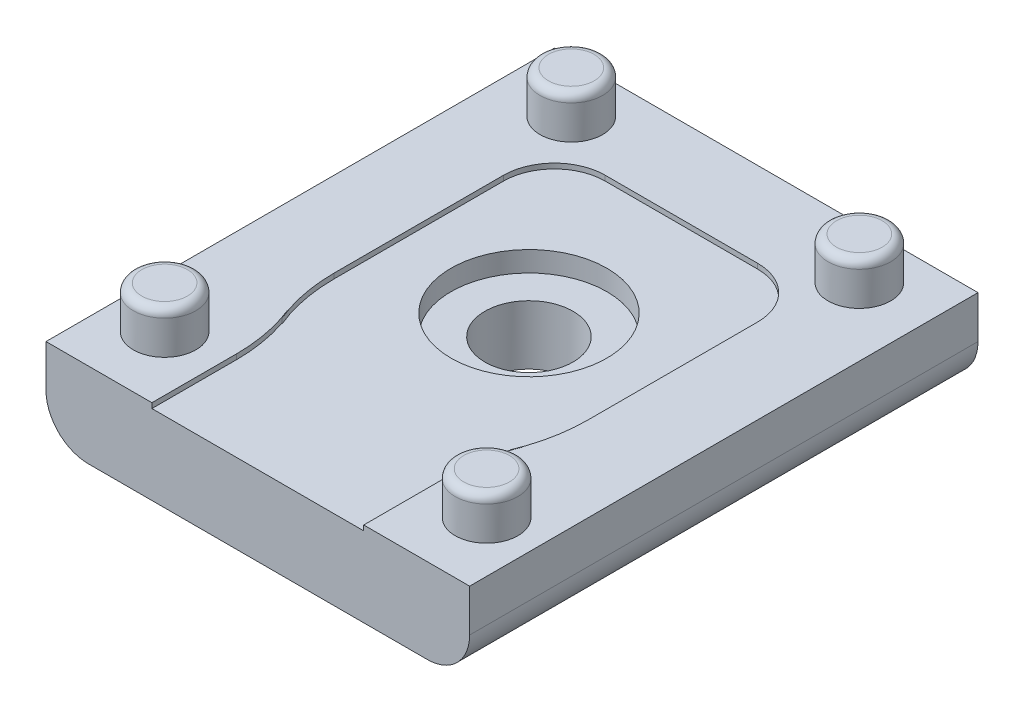
ISO-10303-21;
HEADER;
FILE_DESCRIPTION(('STEP AP214'),'2;1');
FILE_NAME('part.step','',(''),(''),'','','');
FILE_SCHEMA(('AUTOMOTIVE_DESIGN { 1 0 10303 214 1 1 1 1 }'));
ENDSEC;
DATA;
#1=APPLICATION_CONTEXT('core data for automotive mechanical design processes');
#2=APPLICATION_PROTOCOL_DEFINITION('international standard','automotive_design',2000,#1);
#3=PRODUCT_CONTEXT('',#1,'mechanical');
#4=PRODUCT('Part','Part','',(#3));
#5=PRODUCT_RELATED_PRODUCT_CATEGORY('part','',(#4));
#6=PRODUCT_DEFINITION_FORMATION('','',#4);
#7=PRODUCT_DEFINITION_CONTEXT('part definition',#1,'design');
#8=PRODUCT_DEFINITION('design','',#6,#7);
#9=PRODUCT_DEFINITION_SHAPE('','',#8);
#10=(LENGTH_UNIT() NAMED_UNIT(*) SI_UNIT(.MILLI.,.METRE.));
#11=(NAMED_UNIT(*) PLANE_ANGLE_UNIT() SI_UNIT($,.RADIAN.));
#12=(NAMED_UNIT(*) SI_UNIT($,.STERADIAN.) SOLID_ANGLE_UNIT());
#13=UNCERTAINTY_MEASURE_WITH_UNIT(LENGTH_MEASURE(1.E-05),#10,'distance_accuracy_value','');
#14=(GEOMETRIC_REPRESENTATION_CONTEXT(3) GLOBAL_UNCERTAINTY_ASSIGNED_CONTEXT((#13)) GLOBAL_UNIT_ASSIGNED_CONTEXT((#10,
#11,#12)) REPRESENTATION_CONTEXT('',''));
#15=CARTESIAN_POINT('',(0.,0.,0.));
#16=DIRECTION('',(0.,0.,1.));
#17=DIRECTION('',(1.,0.,0.));
#18=AXIS2_PLACEMENT_3D('',#15,#16,#17);
#19=CARTESIAN_POINT('',(12.5,-5.,-16.));
#20=DIRECTION('',(0.,1.,0.));
#21=DIRECTION('',(0.,0.,1.));
#22=AXIS2_PLACEMENT_3D('',#19,#20,#21);
#23=CYLINDRICAL_SURFACE('',#22,2.6);
#24=CARTESIAN_POINT('',(12.5,0.,-16.));
#25=DIRECTION('',(0.,-1.,0.));
#26=DIRECTION('',(0.,0.,-1.));
#27=AXIS2_PLACEMENT_3D('',#24,#25,#26);
#28=CIRCLE('',#27,2.6);
#29=CARTESIAN_POINT('',(12.5,0.,-18.6));
#30=VERTEX_POINT('',#29);
#31=EDGE_CURVE('E216',#30,#30,#28,.T.);
#32=ORIENTED_EDGE('',*,*,#31,.T.);
#33=EDGE_LOOP('',(#32));
#34=FACE_BOUND('',#33,.T.);
#35=CARTESIAN_POINT('',(12.5,3.5,-16.));
#36=DIRECTION('',(0.,1.,0.));
#37=DIRECTION('',(0.,0.,1.));
#38=AXIS2_PLACEMENT_3D('',#35,#36,#37);
#39=CIRCLE('',#38,2.6);
#40=CARTESIAN_POINT('',(12.5,3.5,-13.4));
#41=VERTEX_POINT('',#40);
#42=EDGE_CURVE('E418',#41,#41,#39,.F.);
#43=ORIENTED_EDGE('',*,*,#42,.F.);
#44=EDGE_LOOP('',(#43));
#45=FACE_BOUND('',#44,.T.);
#46=ADVANCED_FACE('F41',(#34,#45),#23,.F.);
#47=CARTESIAN_POINT('',(0.,5.,0.));
#48=DIRECTION('',(0.,0.,-1.));
#49=DIRECTION('',(-1.,0.,0.));
#50=AXIS2_PLACEMENT_3D('',#47,#48,#49);
#51=PLANE('',#50);
#52=DIRECTION('',(1.,0.,0.));
#53=VECTOR('',#52,1.);
#54=CARTESIAN_POINT('',(0.,0.,0.));
#55=LINE('',#54,#53);
#56=CARTESIAN_POINT('',(2.5,0.,0.));
#57=VERTEX_POINT('',#56);
#58=CARTESIAN_POINT('',(22.5,0.,0.));
#59=VERTEX_POINT('',#58);
#60=EDGE_CURVE('E304',#57,#59,#55,.T.);
#61=ORIENTED_EDGE('',*,*,#60,.T.);
#62=CARTESIAN_POINT('',(22.5,2.5,0.));
#63=DIRECTION('',(0.,0.,-1.));
#64=DIRECTION('',(-1.,0.,0.));
#65=AXIS2_PLACEMENT_3D('',#62,#63,#64);
#66=CIRCLE('',#65,2.5);
#67=CARTESIAN_POINT('',(25.,2.5,0.));
#68=VERTEX_POINT('',#67);
#69=EDGE_CURVE('E411',#59,#68,#66,.F.);
#70=ORIENTED_EDGE('',*,*,#69,.T.);
#71=DIRECTION('',(0.,-1.,0.));
#72=VECTOR('',#71,1.);
#73=CARTESIAN_POINT('',(25.,5.,0.));
#74=LINE('',#73,#72);
#75=CARTESIAN_POINT('',(25.,5.,0.));
#76=VERTEX_POINT('',#75);
#77=EDGE_CURVE('E370',#76,#68,#74,.T.);
#78=ORIENTED_EDGE('',*,*,#77,.F.);
#79=DIRECTION('',(1.,0.,0.));
#80=VECTOR('',#79,1.);
#81=CARTESIAN_POINT('',(0.,5.,0.));
#82=LINE('',#81,#80);
#83=CARTESIAN_POINT('',(18.75,5.,0.));
#84=VERTEX_POINT('',#83);
#85=EDGE_CURVE('E345',#84,#76,#82,.T.);
#86=ORIENTED_EDGE('',*,*,#85,.F.);
#87=DIRECTION('',(0.,1.,0.));
#88=VECTOR('',#87,1.);
#89=CARTESIAN_POINT('',(18.75,4.7,0.));
#90=LINE('',#89,#88);
#91=CARTESIAN_POINT('',(18.75,4.7,0.));
#92=VERTEX_POINT('',#91);
#93=EDGE_CURVE('E317',#92,#84,#90,.T.);
#94=ORIENTED_EDGE('',*,*,#93,.F.);
#95=DIRECTION('',(1.,0.,0.));
#96=VECTOR('',#95,1.);
#97=CARTESIAN_POINT('',(6.25,4.7,0.));
#98=LINE('',#97,#96);
#99=CARTESIAN_POINT('',(6.25,4.7,0.));
#100=VERTEX_POINT('',#99);
#101=EDGE_CURVE('E240',#100,#92,#98,.T.);
#102=ORIENTED_EDGE('',*,*,#101,.F.);
#103=DIRECTION('',(0.,1.,0.));
#104=VECTOR('',#103,1.);
#105=CARTESIAN_POINT('',(6.25,4.7,0.));
#106=LINE('',#105,#104);
#107=CARTESIAN_POINT('',(6.25,5.,0.));
#108=VERTEX_POINT('',#107);
#109=EDGE_CURVE('E320',#100,#108,#106,.T.);
#110=ORIENTED_EDGE('',*,*,#109,.T.);
#111=CARTESIAN_POINT('',(0.,5.,0.));
#112=VERTEX_POINT('',#111);
#113=EDGE_CURVE('E347',#112,#108,#82,.T.);
#114=ORIENTED_EDGE('',*,*,#113,.F.);
#115=DIRECTION('',(0.,-1.,0.));
#116=VECTOR('',#115,1.);
#117=CARTESIAN_POINT('',(0.,5.,0.));
#118=LINE('',#117,#116);
#119=CARTESIAN_POINT('',(0.,2.5,0.));
#120=VERTEX_POINT('',#119);
#121=EDGE_CURVE('E374',#112,#120,#118,.T.);
#122=ORIENTED_EDGE('',*,*,#121,.T.);
#123=CARTESIAN_POINT('',(2.5,2.5,0.));
#124=DIRECTION('',(0.,0.,-1.));
#125=DIRECTION('',(-1.,0.,0.));
#126=AXIS2_PLACEMENT_3D('',#123,#124,#125);
#127=CIRCLE('',#126,2.5);
#128=EDGE_CURVE('E57',#120,#57,#127,.F.);
#129=ORIENTED_EDGE('',*,*,#128,.T.);
#130=EDGE_LOOP('',(#61,#70,#78,#86,#94,#102,#110,#114,#122,#129));
#131=FACE_BOUND('',#130,.T.);
#132=ADVANCED_FACE('F465',(#131),#51,.F.);
#133=CARTESIAN_POINT('',(0.,5.,0.));
#134=DIRECTION('',(0.,-1.,0.));
#135=DIRECTION('',(0.,0.,-1.));
#136=AXIS2_PLACEMENT_3D('',#133,#134,#135);
#137=PLANE('',#136);
#138=CARTESIAN_POINT('',(3.,5.,-4.));
#139=DIRECTION('',(0.,-1.,0.));
#140=DIRECTION('',(0.,0.,-1.));
#141=AXIS2_PLACEMENT_3D('',#138,#139,#140);
#142=CIRCLE('',#141,1.85);
#143=CARTESIAN_POINT('',(3.,5.,-5.85));
#144=VERTEX_POINT('',#143);
#145=EDGE_CURVE('E390',#144,#144,#142,.F.);
#146=ORIENTED_EDGE('',*,*,#145,.F.);
#147=EDGE_LOOP('',(#146));
#148=FACE_BOUND('',#147,.T.);
#149=CARTESIAN_POINT('',(22.,5.,-4.));
#150=DIRECTION('',(0.,-1.,0.));
#151=DIRECTION('',(0.,0.,-1.));
#152=AXIS2_PLACEMENT_3D('',#149,#150,#151);
#153=CIRCLE('',#152,1.85);
#154=CARTESIAN_POINT('',(22.,5.,-5.85));
#155=VERTEX_POINT('',#154);
#156=EDGE_CURVE('E386',#155,#155,#153,.F.);
#157=ORIENTED_EDGE('',*,*,#156,.F.);
#158=EDGE_LOOP('',(#157));
#159=FACE_BOUND('',#158,.T.);
#160=CARTESIAN_POINT('',(21.,5.,-27.));
#161=DIRECTION('',(0.,-1.,0.));
#162=DIRECTION('',(0.,0.,-1.));
#163=AXIS2_PLACEMENT_3D('',#160,#161,#162);
#164=CIRCLE('',#163,1.85);
#165=CARTESIAN_POINT('',(21.,5.,-28.85));
#166=VERTEX_POINT('',#165);
#167=EDGE_CURVE('E382',#166,#166,#164,.F.);
#168=ORIENTED_EDGE('',*,*,#167,.F.);
#169=EDGE_LOOP('',(#168));
#170=FACE_BOUND('',#169,.T.);
#171=CARTESIAN_POINT('',(3.99999999999999,5.,-27.));
#172=DIRECTION('',(0.,-1.,0.));
#173=DIRECTION('',(0.,0.,-1.));
#174=AXIS2_PLACEMENT_3D('',#171,#172,#173);
#175=CIRCLE('',#174,1.85);
#176=CARTESIAN_POINT('',(3.99999999999999,5.,-28.85));
#177=VERTEX_POINT('',#176);
#178=EDGE_CURVE('E378',#177,#177,#175,.F.);
#179=ORIENTED_EDGE('',*,*,#178,.F.);
#180=EDGE_LOOP('',(#179));
#181=FACE_BOUND('',#180,.T.);
#182=DIRECTION('',(0.,0.,1.));
#183=VECTOR('',#182,1.);
#184=CARTESIAN_POINT('',(18.75,5.,-4.99999999999996));
#185=LINE('',#184,#183);
#186=CARTESIAN_POINT('',(18.75,5.,-4.99999999999997));
#187=VERTEX_POINT('',#186);
#188=EDGE_CURVE('E286',#187,#84,#185,.T.);
#189=ORIENTED_EDGE('',*,*,#188,.T.);
#190=ORIENTED_EDGE('',*,*,#85,.T.);
#191=DIRECTION('',(0.,0.,-1.));
#192=VECTOR('',#191,1.);
#193=CARTESIAN_POINT('',(25.,5.,0.));
#194=LINE('',#193,#192);
#195=CARTESIAN_POINT('',(25.,5.,-30.));
#196=VERTEX_POINT('',#195);
#197=EDGE_CURVE('E351',#76,#196,#194,.T.);
#198=ORIENTED_EDGE('',*,*,#197,.T.);
#199=DIRECTION('',(-1.,0.,0.));
#200=VECTOR('',#199,1.);
#201=CARTESIAN_POINT('',(0.,5.,-30.));
#202=LINE('',#201,#200);
#203=CARTESIAN_POINT('',(0.,5.,-30.));
#204=VERTEX_POINT('',#203);
#205=EDGE_CURVE('E354',#196,#204,#202,.T.);
#206=ORIENTED_EDGE('',*,*,#205,.T.);
#207=DIRECTION('',(0.,0.,1.));
#208=VECTOR('',#207,1.);
#209=CARTESIAN_POINT('',(0.,5.,0.));
#210=LINE('',#209,#208);
#211=EDGE_CURVE('E341',#204,#112,#210,.T.);
#212=ORIENTED_EDGE('',*,*,#211,.T.);
#213=ORIENTED_EDGE('',*,*,#113,.T.);
#214=DIRECTION('',(0.,0.,1.));
#215=VECTOR('',#214,1.);
#216=CARTESIAN_POINT('',(6.24999999999999,5.,-5.00000000000001));
#217=LINE('',#216,#215);
#218=CARTESIAN_POINT('',(6.24999999999999,5.,-5.00000000000001));
#219=VERTEX_POINT('',#218);
#220=EDGE_CURVE('E283',#219,#108,#217,.T.);
#221=ORIENTED_EDGE('',*,*,#220,.F.);
#222=CARTESIAN_POINT('',(-3.75000000000001,5.,-5.00000000000002));
#223=DIRECTION('',(0.,-1.,0.));
#224=DIRECTION('',(0.,0.,-1.));
#225=AXIS2_PLACEMENT_3D('',#222,#223,#224);
#226=CIRCLE('',#225,10.);
#227=CARTESIAN_POINT('',(5.48076923076923,5.,-8.84615384615384));
#228=VERTEX_POINT('',#227);
#229=EDGE_CURVE('E279',#228,#219,#226,.T.);
#230=ORIENTED_EDGE('',*,*,#229,.F.);
#231=DIRECTION('',(-0.384615384615383,0.,-0.923076923076924));
#232=VECTOR('',#231,1.);
#233=CARTESIAN_POINT('',(5.76923076923076,5.,-8.15384615384617));
#234=LINE('',#233,#232);
#235=CARTESIAN_POINT('',(5.76923076923076,5.,-8.15384615384617));
#236=VERTEX_POINT('',#235);
#237=EDGE_CURVE('E275',#236,#228,#234,.T.);
#238=ORIENTED_EDGE('',*,*,#237,.F.);
#239=CARTESIAN_POINT('',(15.,5.,-12.));
#240=DIRECTION('',(0.,-1.,0.));
#241=DIRECTION('',(0.,0.,-1.));
#242=AXIS2_PLACEMENT_3D('',#239,#240,#241);
#243=CIRCLE('',#242,10.);
#244=CARTESIAN_POINT('',(4.99999999999999,5.,-12.));
#245=VERTEX_POINT('',#244);
#246=EDGE_CURVE('E271',#236,#245,#243,.T.);
#247=ORIENTED_EDGE('',*,*,#246,.T.);
#248=DIRECTION('',(0.,0.,1.));
#249=VECTOR('',#248,1.);
#250=CARTESIAN_POINT('',(4.99999999999999,5.,-22.));
#251=LINE('',#250,#249);
#252=CARTESIAN_POINT('',(4.99999999999999,5.,-22.));
#253=VERTEX_POINT('',#252);
#254=EDGE_CURVE('E267',#253,#245,#251,.T.);
#255=ORIENTED_EDGE('',*,*,#254,.F.);
#256=CARTESIAN_POINT('',(7.99999999999999,5.,-22.));
#257=DIRECTION('',(0.,1.,0.));
#258=DIRECTION('',(0.,0.,1.));
#259=AXIS2_PLACEMENT_3D('',#256,#257,#258);
#260=CIRCLE('',#259,3.);
#261=CARTESIAN_POINT('',(7.99999999999999,5.,-25.));
#262=VERTEX_POINT('',#261);
#263=EDGE_CURVE('E263',#262,#253,#260,.T.);
#264=ORIENTED_EDGE('',*,*,#263,.F.);
#265=DIRECTION('',(1.,0.,0.));
#266=VECTOR('',#265,1.);
#267=CARTESIAN_POINT('',(7.99999999999999,5.,-25.));
#268=LINE('',#267,#266);
#269=CARTESIAN_POINT('',(17.,5.,-25.));
#270=VERTEX_POINT('',#269);
#271=EDGE_CURVE('E260',#262,#270,#268,.T.);
#272=ORIENTED_EDGE('',*,*,#271,.T.);
#273=CARTESIAN_POINT('',(17.,5.,-22.));
#274=DIRECTION('',(0.,1.,0.));
#275=DIRECTION('',(0.,0.,1.));
#276=AXIS2_PLACEMENT_3D('',#273,#274,#275);
#277=CIRCLE('',#276,3.);
#278=CARTESIAN_POINT('',(20.,5.,-22.));
#279=VERTEX_POINT('',#278);
#280=EDGE_CURVE('E201',#279,#270,#277,.T.);
#281=ORIENTED_EDGE('',*,*,#280,.F.);
#282=DIRECTION('',(0.,0.,1.));
#283=VECTOR('',#282,1.);
#284=CARTESIAN_POINT('',(20.,5.,-22.));
#285=LINE('',#284,#283);
#286=CARTESIAN_POINT('',(20.,5.,-12.));
#287=VERTEX_POINT('',#286);
#288=EDGE_CURVE('E209',#279,#287,#285,.T.);
#289=ORIENTED_EDGE('',*,*,#288,.T.);
#290=CARTESIAN_POINT('',(10.,5.,-12.));
#291=DIRECTION('',(0.,1.,0.));
#292=DIRECTION('',(0.,0.,1.));
#293=AXIS2_PLACEMENT_3D('',#290,#291,#292);
#294=CIRCLE('',#293,10.);
#295=CARTESIAN_POINT('',(19.2307692307692,5.,-8.15384615384606));
#296=VERTEX_POINT('',#295);
#297=EDGE_CURVE('E213',#296,#287,#294,.T.);
#298=ORIENTED_EDGE('',*,*,#297,.F.);
#299=DIRECTION('',(0.384615384615399,0.,-0.923076923076917));
#300=VECTOR('',#299,1.);
#301=CARTESIAN_POINT('',(19.2307692307692,5.,-8.15384615384606));
#302=LINE('',#301,#300);
#303=CARTESIAN_POINT('',(19.5192307692308,5.,-8.8461538461539));
#304=VERTEX_POINT('',#303);
#305=EDGE_CURVE('E294',#296,#304,#302,.T.);
#306=ORIENTED_EDGE('',*,*,#305,.T.);
#307=CARTESIAN_POINT('',(28.75,5.,-4.99999999999995));
#308=DIRECTION('',(0.,1.,0.));
#309=DIRECTION('',(0.,0.,1.));
#310=AXIS2_PLACEMENT_3D('',#307,#308,#309);
#311=CIRCLE('',#310,10.);
#312=EDGE_CURVE('E290',#304,#187,#311,.T.);
#313=ORIENTED_EDGE('',*,*,#312,.T.);
#314=EDGE_LOOP('',(#189,#190,#198,#206,#212,#213,#221,#230,#238,#247,#255,#264,#272,#281,#289,
#298,#306,#313));
#315=FACE_BOUND('',#314,.T.);
#316=ADVANCED_FACE('F471',(#148,#159,#170,#181,#315),#137,.F.);
#317=CARTESIAN_POINT('',(0.,5.,0.));
#318=DIRECTION('',(1.,0.,0.));
#319=DIRECTION('',(0.,0.,-1.));
#320=AXIS2_PLACEMENT_3D('',#317,#318,#319);
#321=PLANE('',#320);
#322=DIRECTION('',(0.,-1.,0.));
#323=VECTOR('',#322,1.);
#324=CARTESIAN_POINT('',(0.,5.,-30.));
#325=LINE('',#324,#323);
#326=CARTESIAN_POINT('',(0.,2.5,-30.));
#327=VERTEX_POINT('',#326);
#328=EDGE_CURVE('E357',#204,#327,#325,.T.);
#329=ORIENTED_EDGE('',*,*,#328,.T.);
#330=DIRECTION('',(0.,0.,1.));
#331=VECTOR('',#330,1.);
#332=CARTESIAN_POINT('',(0.,2.5,0.));
#333=LINE('',#332,#331);
#334=EDGE_CURVE('E414',#327,#120,#333,.T.);
#335=ORIENTED_EDGE('',*,*,#334,.T.);
#336=ORIENTED_EDGE('',*,*,#121,.F.);
#337=ORIENTED_EDGE('',*,*,#211,.F.);
#338=EDGE_LOOP('',(#329,#335,#336,#337));
#339=FACE_BOUND('',#338,.T.);
#340=ADVANCED_FACE('F565',(#339),#321,.F.);
#341=CARTESIAN_POINT('',(25.,5.,0.));
#342=DIRECTION('',(-1.,0.,0.));
#343=DIRECTION('',(0.,0.,1.));
#344=AXIS2_PLACEMENT_3D('',#341,#342,#343);
#345=PLANE('',#344);
#346=ORIENTED_EDGE('',*,*,#77,.T.);
#347=DIRECTION('',(0.,0.,-1.));
#348=VECTOR('',#347,1.);
#349=CARTESIAN_POINT('',(25.,2.5,-30.));
#350=LINE('',#349,#348);
#351=CARTESIAN_POINT('',(25.,2.5,-30.));
#352=VERTEX_POINT('',#351);
#353=EDGE_CURVE('E394',#68,#352,#350,.T.);
#354=ORIENTED_EDGE('',*,*,#353,.T.);
#355=DIRECTION('',(0.,-1.,0.));
#356=VECTOR('',#355,1.);
#357=CARTESIAN_POINT('',(25.,5.,-30.));
#358=LINE('',#357,#356);
#359=EDGE_CURVE('E366',#196,#352,#358,.T.);
#360=ORIENTED_EDGE('',*,*,#359,.F.);
#361=ORIENTED_EDGE('',*,*,#197,.F.);
#362=EDGE_LOOP('',(#346,#354,#360,#361));
#363=FACE_BOUND('',#362,.T.);
#364=ADVANCED_FACE('F573',(#363),#345,.F.);
#365=CARTESIAN_POINT('',(0.,5.,-30.));
#366=DIRECTION('',(0.,0.,1.));
#367=DIRECTION('',(1.,0.,0.));
#368=AXIS2_PLACEMENT_3D('',#365,#366,#367);
#369=PLANE('',#368);
#370=ORIENTED_EDGE('',*,*,#359,.T.);
#371=CARTESIAN_POINT('',(22.5,2.5,-30.));
#372=DIRECTION('',(0.,0.,1.));
#373=DIRECTION('',(1.,0.,0.));
#374=AXIS2_PLACEMENT_3D('',#371,#372,#373);
#375=CIRCLE('',#374,2.5);
#376=CARTESIAN_POINT('',(22.5,0.,-30.));
#377=VERTEX_POINT('',#376);
#378=EDGE_CURVE('E401',#352,#377,#375,.F.);
#379=ORIENTED_EDGE('',*,*,#378,.T.);
#380=DIRECTION('',(-1.,0.,0.));
#381=VECTOR('',#380,1.);
#382=CARTESIAN_POINT('',(0.,0.,-30.));
#383=LINE('',#382,#381);
#384=CARTESIAN_POINT('',(2.49999999999999,0.,-30.));
#385=VERTEX_POINT('',#384);
#386=EDGE_CURVE('E346',#377,#385,#383,.T.);
#387=ORIENTED_EDGE('',*,*,#386,.T.);
#388=CARTESIAN_POINT('',(2.49999999999999,2.5,-30.));
#389=DIRECTION('',(0.,0.,1.));
#390=DIRECTION('',(1.,0.,0.));
#391=AXIS2_PLACEMENT_3D('',#388,#389,#390);
#392=CIRCLE('',#391,2.5);
#393=EDGE_CURVE('E398',#385,#327,#392,.F.);
#394=ORIENTED_EDGE('',*,*,#393,.T.);
#395=ORIENTED_EDGE('',*,*,#328,.F.);
#396=ORIENTED_EDGE('',*,*,#205,.F.);
#397=EDGE_LOOP('',(#370,#379,#387,#394,#395,#396));
#398=FACE_BOUND('',#397,.T.);
#399=ADVANCED_FACE('F569',(#398),#369,.F.);
#400=CARTESIAN_POINT('',(0.,0.,0.));
#401=DIRECTION('',(0.,-1.,0.));
#402=DIRECTION('',(0.,0.,-1.));
#403=AXIS2_PLACEMENT_3D('',#400,#401,#402);
#404=PLANE('',#403);
#405=ORIENTED_EDGE('',*,*,#31,.F.);
#406=EDGE_LOOP('',(#405));
#407=FACE_BOUND('',#406,.T.);
#408=ORIENTED_EDGE('',*,*,#386,.F.);
#409=DIRECTION('',(0.,0.,-1.));
#410=VECTOR('',#409,1.);
#411=CARTESIAN_POINT('',(22.5,0.,0.));
#412=LINE('',#411,#410);
#413=EDGE_CURVE('E65',#377,#59,#412,.F.);
#414=ORIENTED_EDGE('',*,*,#413,.T.);
#415=ORIENTED_EDGE('',*,*,#60,.F.);
#416=DIRECTION('',(0.,0.,1.));
#417=VECTOR('',#416,1.);
#418=CARTESIAN_POINT('',(2.49999999999999,0.,-30.));
#419=LINE('',#418,#417);
#420=EDGE_CURVE('E404',#57,#385,#419,.F.);
#421=ORIENTED_EDGE('',*,*,#420,.T.);
#422=EDGE_LOOP('',(#408,#414,#415,#421));
#423=FACE_BOUND('',#422,.T.);
#424=ADVANCED_FACE('F562',(#407,#423),#404,.T.);
#425=CARTESIAN_POINT('',(17.,4.7,-22.));
#426=DIRECTION('',(0.,1.,0.));
#427=DIRECTION('',(0.,0.,1.));
#428=AXIS2_PLACEMENT_3D('',#425,#426,#427);
#429=CYLINDRICAL_SURFACE('',#428,3.);
#430=ORIENTED_EDGE('',*,*,#280,.T.);
#431=DIRECTION('',(0.,1.,0.));
#432=VECTOR('',#431,1.);
#433=CARTESIAN_POINT('',(17.,4.7,-25.));
#434=LINE('',#433,#432);
#435=CARTESIAN_POINT('',(17.,4.7,-25.));
#436=VERTEX_POINT('',#435);
#437=EDGE_CURVE('E186',#436,#270,#434,.T.);
#438=ORIENTED_EDGE('',*,*,#437,.F.);
#439=CARTESIAN_POINT('',(17.,4.7,-22.));
#440=DIRECTION('',(0.,1.,0.));
#441=DIRECTION('',(0.,0.,1.));
#442=AXIS2_PLACEMENT_3D('',#439,#440,#441);
#443=CIRCLE('',#442,3.);
#444=CARTESIAN_POINT('',(20.,4.7,-22.));
#445=VERTEX_POINT('',#444);
#446=EDGE_CURVE('E195',#445,#436,#443,.T.);
#447=ORIENTED_EDGE('',*,*,#446,.F.);
#448=DIRECTION('',(0.,1.,0.));
#449=VECTOR('',#448,1.);
#450=CARTESIAN_POINT('',(20.,4.7,-22.));
#451=LINE('',#450,#449);
#452=EDGE_CURVE('E301',#445,#279,#451,.T.);
#453=ORIENTED_EDGE('',*,*,#452,.T.);
#454=EDGE_LOOP('',(#430,#438,#447,#453));
#455=FACE_BOUND('',#454,.T.);
#456=ADVANCED_FACE('F199',(#455),#429,.F.);
#457=CARTESIAN_POINT('',(20.,4.7,-22.));
#458=DIRECTION('',(-1.,0.,0.));
#459=DIRECTION('',(0.,0.,1.));
#460=AXIS2_PLACEMENT_3D('',#457,#458,#459);
#461=PLANE('',#460);
#462=ORIENTED_EDGE('',*,*,#288,.F.);
#463=ORIENTED_EDGE('',*,*,#452,.F.);
#464=DIRECTION('',(0.,0.,1.));
#465=VECTOR('',#464,1.);
#466=CARTESIAN_POINT('',(20.,4.7,-22.));
#467=LINE('',#466,#465);
#468=CARTESIAN_POINT('',(20.,4.7,-12.));
#469=VERTEX_POINT('',#468);
#470=EDGE_CURVE('E203',#445,#469,#467,.T.);
#471=ORIENTED_EDGE('',*,*,#470,.T.);
#472=DIRECTION('',(0.,1.,0.));
#473=VECTOR('',#472,1.);
#474=CARTESIAN_POINT('',(20.,4.7,-12.));
#475=LINE('',#474,#473);
#476=EDGE_CURVE('E305',#469,#287,#475,.T.);
#477=ORIENTED_EDGE('',*,*,#476,.T.);
#478=EDGE_LOOP('',(#462,#463,#471,#477));
#479=FACE_BOUND('',#478,.T.);
#480=ADVANCED_FACE('F514',(#479),#461,.T.);
#481=CARTESIAN_POINT('',(10.,4.7,-12.));
#482=DIRECTION('',(0.,1.,0.));
#483=DIRECTION('',(0.,0.,1.));
#484=AXIS2_PLACEMENT_3D('',#481,#482,#483);
#485=CYLINDRICAL_SURFACE('',#484,10.);
#486=ORIENTED_EDGE('',*,*,#297,.T.);
#487=ORIENTED_EDGE('',*,*,#476,.F.);
#488=CARTESIAN_POINT('',(10.,4.7,-12.));
#489=DIRECTION('',(0.,1.,0.));
#490=DIRECTION('',(0.,0.,1.));
#491=AXIS2_PLACEMENT_3D('',#488,#489,#490);
#492=CIRCLE('',#491,10.);
#493=CARTESIAN_POINT('',(19.2307692307692,4.7,-8.15384615384606));
#494=VERTEX_POINT('',#493);
#495=EDGE_CURVE('E253',#494,#469,#492,.T.);
#496=ORIENTED_EDGE('',*,*,#495,.F.);
#497=DIRECTION('',(0.,1.,0.));
#498=VECTOR('',#497,1.);
#499=CARTESIAN_POINT('',(19.2307692307692,4.7,-8.15384615384606));
#500=LINE('',#499,#498);
#501=EDGE_CURVE('E308',#494,#296,#500,.T.);
#502=ORIENTED_EDGE('',*,*,#501,.T.);
#503=EDGE_LOOP('',(#486,#487,#496,#502));
#504=FACE_BOUND('',#503,.T.);
#505=ADVANCED_FACE('F517',(#504),#485,.F.);
#506=CARTESIAN_POINT('',(19.2307692307692,4.7,-8.15384615384606));
#507=DIRECTION('',(0.923076923076917,0.,0.384615384615399));
#508=DIRECTION('',(0.384615384615399,0.,-0.923076923076917));
#509=AXIS2_PLACEMENT_3D('',#506,#507,#508);
#510=PLANE('',#509);
#511=ORIENTED_EDGE('',*,*,#305,.F.);
#512=ORIENTED_EDGE('',*,*,#501,.F.);
#513=DIRECTION('',(0.384615384615399,0.,-0.923076923076917));
#514=VECTOR('',#513,1.);
#515=CARTESIAN_POINT('',(19.2307692307692,4.7,-8.15384615384606));
#516=LINE('',#515,#514);
#517=CARTESIAN_POINT('',(19.5192307692308,4.7,-8.8461538461539));
#518=VERTEX_POINT('',#517);
#519=EDGE_CURVE('E250',#494,#518,#516,.T.);
#520=ORIENTED_EDGE('',*,*,#519,.T.);
#521=DIRECTION('',(0.,1.,0.));
#522=VECTOR('',#521,1.);
#523=CARTESIAN_POINT('',(19.5192307692308,4.7,-8.8461538461539));
#524=LINE('',#523,#522);
#525=EDGE_CURVE('E311',#518,#304,#524,.T.);
#526=ORIENTED_EDGE('',*,*,#525,.T.);
#527=EDGE_LOOP('',(#511,#512,#520,#526));
#528=FACE_BOUND('',#527,.T.);
#529=ADVANCED_FACE('F521',(#528),#510,.T.);
#530=CARTESIAN_POINT('',(28.75,4.7,-4.99999999999995));
#531=DIRECTION('',(0.,1.,0.));
#532=DIRECTION('',(0.,0.,1.));
#533=AXIS2_PLACEMENT_3D('',#530,#531,#532);
#534=CYLINDRICAL_SURFACE('',#533,10.);
#535=ORIENTED_EDGE('',*,*,#312,.F.);
#536=ORIENTED_EDGE('',*,*,#525,.F.);
#537=CARTESIAN_POINT('',(28.75,4.7,-4.99999999999995));
#538=DIRECTION('',(0.,1.,0.));
#539=DIRECTION('',(0.,0.,1.));
#540=AXIS2_PLACEMENT_3D('',#537,#538,#539);
#541=CIRCLE('',#540,10.);
#542=CARTESIAN_POINT('',(18.75,4.7,-4.99999999999997));
#543=VERTEX_POINT('',#542);
#544=EDGE_CURVE('E247',#518,#543,#541,.T.);
#545=ORIENTED_EDGE('',*,*,#544,.T.);
#546=DIRECTION('',(0.,1.,0.));
#547=VECTOR('',#546,1.);
#548=CARTESIAN_POINT('',(18.75,4.7,-4.99999999999997));
#549=LINE('',#548,#547);
#550=EDGE_CURVE('E314',#543,#187,#549,.T.);
#551=ORIENTED_EDGE('',*,*,#550,.T.);
#552=EDGE_LOOP('',(#535,#536,#545,#551));
#553=FACE_BOUND('',#552,.T.);
#554=ADVANCED_FACE('F525',(#553),#534,.T.);
#555=CARTESIAN_POINT('',(18.75,4.7,-4.99999999999996));
#556=DIRECTION('',(-1.,0.,0.));
#557=DIRECTION('',(0.,0.,1.));
#558=AXIS2_PLACEMENT_3D('',#555,#556,#557);
#559=PLANE('',#558);
#560=ORIENTED_EDGE('',*,*,#188,.F.);
#561=ORIENTED_EDGE('',*,*,#550,.F.);
#562=DIRECTION('',(0.,0.,1.));
#563=VECTOR('',#562,1.);
#564=CARTESIAN_POINT('',(18.75,4.7,-4.99999999999996));
#565=LINE('',#564,#563);
#566=EDGE_CURVE('E244',#543,#92,#565,.T.);
#567=ORIENTED_EDGE('',*,*,#566,.T.);
#568=ORIENTED_EDGE('',*,*,#93,.T.);
#569=EDGE_LOOP('',(#560,#561,#567,#568));
#570=FACE_BOUND('',#569,.T.);
#571=ADVANCED_FACE('F529',(#570),#559,.T.);
#572=CARTESIAN_POINT('',(6.24999999999999,4.7,-5.00000000000001));
#573=DIRECTION('',(-1.,0.,0.));
#574=DIRECTION('',(0.,0.,1.));
#575=AXIS2_PLACEMENT_3D('',#572,#573,#574);
#576=PLANE('',#575);
#577=ORIENTED_EDGE('',*,*,#220,.T.);
#578=ORIENTED_EDGE('',*,*,#109,.F.);
#579=DIRECTION('',(0.,0.,1.));
#580=VECTOR('',#579,1.);
#581=CARTESIAN_POINT('',(6.24999999999999,4.7,-5.00000000000001));
#582=LINE('',#581,#580);
#583=CARTESIAN_POINT('',(6.24999999999999,4.7,-5.00000000000001));
#584=VERTEX_POINT('',#583);
#585=EDGE_CURVE('E236',#584,#100,#582,.T.);
#586=ORIENTED_EDGE('',*,*,#585,.F.);
#587=DIRECTION('',(0.,1.,0.));
#588=VECTOR('',#587,1.);
#589=CARTESIAN_POINT('',(6.24999999999999,4.7,-5.00000000000001));
#590=LINE('',#589,#588);
#591=EDGE_CURVE('E324',#584,#219,#590,.T.);
#592=ORIENTED_EDGE('',*,*,#591,.T.);
#593=EDGE_LOOP('',(#577,#578,#586,#592));
#594=FACE_BOUND('',#593,.T.);
#595=ADVANCED_FACE('F533',(#594),#576,.F.);
#596=CARTESIAN_POINT('',(-3.75000000000001,4.7,-5.00000000000002));
#597=DIRECTION('',(0.,1.,0.));
#598=DIRECTION('',(0.,0.,1.));
#599=AXIS2_PLACEMENT_3D('',#596,#597,#598);
#600=CYLINDRICAL_SURFACE('',#599,10.);
#601=ORIENTED_EDGE('',*,*,#229,.T.);
#602=ORIENTED_EDGE('',*,*,#591,.F.);
#603=CARTESIAN_POINT('',(-3.75000000000001,4.7,-5.00000000000002));
#604=DIRECTION('',(0.,-1.,0.));
#605=DIRECTION('',(0.,0.,-1.));
#606=AXIS2_PLACEMENT_3D('',#603,#604,#605);
#607=CIRCLE('',#606,10.);
#608=CARTESIAN_POINT('',(5.48076923076923,4.7,-8.84615384615384));
#609=VERTEX_POINT('',#608);
#610=EDGE_CURVE('E232',#609,#584,#607,.T.);
#611=ORIENTED_EDGE('',*,*,#610,.F.);
#612=DIRECTION('',(0.,1.,0.));
#613=VECTOR('',#612,1.);
#614=CARTESIAN_POINT('',(5.48076923076923,4.7,-8.84615384615384));
#615=LINE('',#614,#613);
#616=EDGE_CURVE('E327',#609,#228,#615,.T.);
#617=ORIENTED_EDGE('',*,*,#616,.T.);
#618=EDGE_LOOP('',(#601,#602,#611,#617));
#619=FACE_BOUND('',#618,.T.);
#620=ADVANCED_FACE('F537',(#619),#600,.T.);
#621=CARTESIAN_POINT('',(5.76923076923076,4.7,-8.15384615384617));
#622=DIRECTION('',(0.923076923076924,0.,-0.384615384615383));
#623=DIRECTION('',(-0.384615384615383,0.,-0.923076923076924));
#624=AXIS2_PLACEMENT_3D('',#621,#622,#623);
#625=PLANE('',#624);
#626=ORIENTED_EDGE('',*,*,#237,.T.);
#627=ORIENTED_EDGE('',*,*,#616,.F.);
#628=DIRECTION('',(-0.384615384615383,0.,-0.923076923076924));
#629=VECTOR('',#628,1.);
#630=CARTESIAN_POINT('',(5.76923076923076,4.7,-8.15384615384617));
#631=LINE('',#630,#629);
#632=CARTESIAN_POINT('',(5.76923076923076,4.7,-8.15384615384617));
#633=VERTEX_POINT('',#632);
#634=EDGE_CURVE('E228',#633,#609,#631,.T.);
#635=ORIENTED_EDGE('',*,*,#634,.F.);
#636=DIRECTION('',(0.,1.,0.));
#637=VECTOR('',#636,1.);
#638=CARTESIAN_POINT('',(5.76923076923076,4.7,-8.15384615384617));
#639=LINE('',#638,#637);
#640=EDGE_CURVE('E330',#633,#236,#639,.T.);
#641=ORIENTED_EDGE('',*,*,#640,.T.);
#642=EDGE_LOOP('',(#626,#627,#635,#641));
#643=FACE_BOUND('',#642,.T.);
#644=ADVANCED_FACE('F541',(#643),#625,.F.);
#645=CARTESIAN_POINT('',(15.,4.7,-12.));
#646=DIRECTION('',(0.,1.,0.));
#647=DIRECTION('',(0.,0.,1.));
#648=AXIS2_PLACEMENT_3D('',#645,#646,#647);
#649=CYLINDRICAL_SURFACE('',#648,10.);
#650=ORIENTED_EDGE('',*,*,#246,.F.);
#651=ORIENTED_EDGE('',*,*,#640,.F.);
#652=CARTESIAN_POINT('',(15.,4.7,-12.));
#653=DIRECTION('',(0.,-1.,0.));
#654=DIRECTION('',(0.,0.,-1.));
#655=AXIS2_PLACEMENT_3D('',#652,#653,#654);
#656=CIRCLE('',#655,10.);
#657=CARTESIAN_POINT('',(4.99999999999999,4.7,-12.));
#658=VERTEX_POINT('',#657);
#659=EDGE_CURVE('E225',#633,#658,#656,.T.);
#660=ORIENTED_EDGE('',*,*,#659,.T.);
#661=DIRECTION('',(0.,1.,0.));
#662=VECTOR('',#661,1.);
#663=CARTESIAN_POINT('',(4.99999999999999,4.7,-12.));
#664=LINE('',#663,#662);
#665=EDGE_CURVE('E333',#658,#245,#664,.T.);
#666=ORIENTED_EDGE('',*,*,#665,.T.);
#667=EDGE_LOOP('',(#650,#651,#660,#666));
#668=FACE_BOUND('',#667,.T.);
#669=ADVANCED_FACE('F545',(#668),#649,.F.);
#670=CARTESIAN_POINT('',(4.99999999999999,4.7,-22.));
#671=DIRECTION('',(-1.,0.,0.));
#672=DIRECTION('',(0.,0.,1.));
#673=AXIS2_PLACEMENT_3D('',#670,#671,#672);
#674=PLANE('',#673);
#675=ORIENTED_EDGE('',*,*,#254,.T.);
#676=ORIENTED_EDGE('',*,*,#665,.F.);
#677=DIRECTION('',(0.,0.,1.));
#678=VECTOR('',#677,1.);
#679=CARTESIAN_POINT('',(4.99999999999999,4.7,-22.));
#680=LINE('',#679,#678);
#681=CARTESIAN_POINT('',(4.99999999999999,4.7,-22.));
#682=VERTEX_POINT('',#681);
#683=EDGE_CURVE('E221',#682,#658,#680,.T.);
#684=ORIENTED_EDGE('',*,*,#683,.F.);
#685=DIRECTION('',(0.,1.,0.));
#686=VECTOR('',#685,1.);
#687=CARTESIAN_POINT('',(4.99999999999999,4.7,-22.));
#688=LINE('',#687,#686);
#689=EDGE_CURVE('E336',#682,#253,#688,.T.);
#690=ORIENTED_EDGE('',*,*,#689,.T.);
#691=EDGE_LOOP('',(#675,#676,#684,#690));
#692=FACE_BOUND('',#691,.T.);
#693=ADVANCED_FACE('F549',(#692),#674,.F.);
#694=CARTESIAN_POINT('',(7.99999999999999,4.7,-22.));
#695=DIRECTION('',(0.,1.,0.));
#696=DIRECTION('',(0.,0.,1.));
#697=AXIS2_PLACEMENT_3D('',#694,#695,#696);
#698=CYLINDRICAL_SURFACE('',#697,3.);
#699=ORIENTED_EDGE('',*,*,#263,.T.);
#700=ORIENTED_EDGE('',*,*,#689,.F.);
#701=CARTESIAN_POINT('',(7.99999999999999,4.7,-22.));
#702=DIRECTION('',(0.,1.,0.));
#703=DIRECTION('',(0.,0.,1.));
#704=AXIS2_PLACEMENT_3D('',#701,#702,#703);
#705=CIRCLE('',#704,3.);
#706=CARTESIAN_POINT('',(7.99999999999999,4.7,-25.));
#707=VERTEX_POINT('',#706);
#708=EDGE_CURVE('E194',#707,#682,#705,.T.);
#709=ORIENTED_EDGE('',*,*,#708,.F.);
#710=DIRECTION('',(0.,1.,0.));
#711=VECTOR('',#710,1.);
#712=CARTESIAN_POINT('',(7.99999999999999,4.7,-25.));
#713=LINE('',#712,#711);
#714=EDGE_CURVE('E188',#707,#262,#713,.T.);
#715=ORIENTED_EDGE('',*,*,#714,.T.);
#716=EDGE_LOOP('',(#699,#700,#709,#715));
#717=FACE_BOUND('',#716,.T.);
#718=ADVANCED_FACE('F553',(#717),#698,.F.);
#719=CARTESIAN_POINT('',(7.99999999999999,4.7,-25.));
#720=DIRECTION('',(0.,0.,1.));
#721=DIRECTION('',(1.,0.,0.));
#722=AXIS2_PLACEMENT_3D('',#719,#720,#721);
#723=PLANE('',#722);
#724=ORIENTED_EDGE('',*,*,#271,.F.);
#725=ORIENTED_EDGE('',*,*,#714,.F.);
#726=DIRECTION('',(1.,0.,0.));
#727=VECTOR('',#726,1.);
#728=CARTESIAN_POINT('',(7.99999999999999,4.7,-25.));
#729=LINE('',#728,#727);
#730=EDGE_CURVE('E182',#707,#436,#729,.T.);
#731=ORIENTED_EDGE('',*,*,#730,.T.);
#732=ORIENTED_EDGE('',*,*,#437,.T.);
#733=EDGE_LOOP('',(#724,#725,#731,#732));
#734=FACE_BOUND('',#733,.T.);
#735=ADVANCED_FACE('F185',(#734),#723,.T.);
#736=CARTESIAN_POINT('',(17.,4.7,-22.));
#737=DIRECTION('',(0.,1.,0.));
#738=DIRECTION('',(0.,0.,1.));
#739=AXIS2_PLACEMENT_3D('',#736,#737,#738);
#740=PLANE('',#739);
#741=CARTESIAN_POINT('',(12.5,4.7,-16.));
#742=DIRECTION('',(0.,1.,0.));
#743=DIRECTION('',(0.,0.,1.));
#744=AXIS2_PLACEMENT_3D('',#741,#742,#743);
#745=CIRCLE('',#744,4.6);
#746=CARTESIAN_POINT('',(12.5,4.7,-11.4));
#747=VERTEX_POINT('',#746);
#748=EDGE_CURVE('E422',#747,#747,#745,.T.);
#749=ORIENTED_EDGE('',*,*,#748,.F.);
#750=EDGE_LOOP('',(#749));
#751=FACE_BOUND('',#750,.T.);
#752=ORIENTED_EDGE('',*,*,#446,.T.);
#753=ORIENTED_EDGE('',*,*,#730,.F.);
#754=ORIENTED_EDGE('',*,*,#708,.T.);
#755=ORIENTED_EDGE('',*,*,#683,.T.);
#756=ORIENTED_EDGE('',*,*,#659,.F.);
#757=ORIENTED_EDGE('',*,*,#634,.T.);
#758=ORIENTED_EDGE('',*,*,#610,.T.);
#759=ORIENTED_EDGE('',*,*,#585,.T.);
#760=ORIENTED_EDGE('',*,*,#101,.T.);
#761=ORIENTED_EDGE('',*,*,#566,.F.);
#762=ORIENTED_EDGE('',*,*,#544,.F.);
#763=ORIENTED_EDGE('',*,*,#519,.F.);
#764=ORIENTED_EDGE('',*,*,#495,.T.);
#765=ORIENTED_EDGE('',*,*,#470,.F.);
#766=EDGE_LOOP('',(#752,#753,#754,#755,#756,#757,#758,#759,#760,#761,#762,#763,#764,#765));
#767=FACE_BOUND('',#766,.T.);
#768=ADVANCED_FACE('F206',(#751,#767),#740,.T.);
#769=CARTESIAN_POINT('',(3.99999999999999,7.5,-27.));
#770=DIRECTION('',(0.,-1.,0.));
#771=DIRECTION('',(0.,0.,-1.));
#772=AXIS2_PLACEMENT_3D('',#769,#770,#771);
#773=CYLINDRICAL_SURFACE('',#772,1.85);
#774=CARTESIAN_POINT('',(3.99999999999999,7.,-27.));
#775=DIRECTION('',(0.,1.,0.));
#776=DIRECTION('',(0.,0.,1.));
#777=AXIS2_PLACEMENT_3D('',#774,#775,#776);
#778=CIRCLE('',#777,1.85);
#779=CARTESIAN_POINT('',(3.99999999999999,7.,-25.15));
#780=VERTEX_POINT('',#779);
#781=EDGE_CURVE('E446',#780,#780,#778,.F.);
#782=ORIENTED_EDGE('',*,*,#781,.T.);
#783=EDGE_LOOP('',(#782));
#784=FACE_BOUND('',#783,.T.);
#785=ORIENTED_EDGE('',*,*,#178,.T.);
#786=EDGE_LOOP('',(#785));
#787=FACE_BOUND('',#786,.T.);
#788=ADVANCED_FACE('F506',(#784,#787),#773,.T.);
#789=CARTESIAN_POINT('',(3.99999999999999,7.5,-27.));
#790=DIRECTION('',(0.,1.,0.));
#791=DIRECTION('',(0.,0.,1.));
#792=AXIS2_PLACEMENT_3D('',#789,#790,#791);
#793=PLANE('',#792);
#794=CARTESIAN_POINT('',(3.99999999999999,7.5,-27.));
#795=DIRECTION('',(0.,1.,0.));
#796=DIRECTION('',(0.,0.,1.));
#797=AXIS2_PLACEMENT_3D('',#794,#795,#796);
#798=CIRCLE('',#797,1.35);
#799=CARTESIAN_POINT('',(3.99999999999999,7.5,-25.65));
#800=VERTEX_POINT('',#799);
#801=EDGE_CURVE('E442',#800,#800,#798,.T.);
#802=ORIENTED_EDGE('',*,*,#801,.T.);
#803=EDGE_LOOP('',(#802));
#804=FACE_BOUND('',#803,.T.);
#805=ADVANCED_FACE('F500',(#804),#793,.T.);
#806=CARTESIAN_POINT('',(21.,7.5,-27.));
#807=DIRECTION('',(0.,-1.,0.));
#808=DIRECTION('',(0.,0.,-1.));
#809=AXIS2_PLACEMENT_3D('',#806,#807,#808);
#810=CYLINDRICAL_SURFACE('',#809,1.85);
#811=CARTESIAN_POINT('',(21.,7.,-27.));
#812=DIRECTION('',(0.,1.,0.));
#813=DIRECTION('',(0.,0.,1.));
#814=AXIS2_PLACEMENT_3D('',#811,#812,#813);
#815=CIRCLE('',#814,1.85);
#816=CARTESIAN_POINT('',(21.,7.,-25.15));
#817=VERTEX_POINT('',#816);
#818=EDGE_CURVE('E11',#817,#817,#815,.F.);
#819=ORIENTED_EDGE('',*,*,#818,.T.);
#820=EDGE_LOOP('',(#819));
#821=FACE_BOUND('',#820,.T.);
#822=ORIENTED_EDGE('',*,*,#167,.T.);
#823=EDGE_LOOP('',(#822));
#824=FACE_BOUND('',#823,.T.);
#825=ADVANCED_FACE('F497',(#821,#824),#810,.T.);
#826=CARTESIAN_POINT('',(21.,7.5,-27.));
#827=DIRECTION('',(0.,1.,0.));
#828=DIRECTION('',(0.,0.,1.));
#829=AXIS2_PLACEMENT_3D('',#826,#827,#828);
#830=PLANE('',#829);
#831=CARTESIAN_POINT('',(21.,7.5,-27.));
#832=DIRECTION('',(0.,1.,0.));
#833=DIRECTION('',(0.,0.,1.));
#834=AXIS2_PLACEMENT_3D('',#831,#832,#833);
#835=CIRCLE('',#834,1.35);
#836=CARTESIAN_POINT('',(21.,7.5,-25.65));
#837=VERTEX_POINT('',#836);
#838=EDGE_CURVE('E50',#837,#837,#835,.T.);
#839=ORIENTED_EDGE('',*,*,#838,.T.);
#840=EDGE_LOOP('',(#839));
#841=FACE_BOUND('',#840,.T.);
#842=ADVANCED_FACE('F453',(#841),#830,.T.);
#843=CARTESIAN_POINT('',(22.,7.5,-4.));
#844=DIRECTION('',(0.,-1.,0.));
#845=DIRECTION('',(0.,0.,-1.));
#846=AXIS2_PLACEMENT_3D('',#843,#844,#845);
#847=CYLINDRICAL_SURFACE('',#846,1.85);
#848=CARTESIAN_POINT('',(22.,7.,-4.));
#849=DIRECTION('',(0.,1.,0.));
#850=DIRECTION('',(0.,0.,1.));
#851=AXIS2_PLACEMENT_3D('',#848,#849,#850);
#852=CIRCLE('',#851,1.85);
#853=CARTESIAN_POINT('',(22.,7.,-2.15));
#854=VERTEX_POINT('',#853);
#855=EDGE_CURVE('E430',#854,#854,#852,.F.);
#856=ORIENTED_EDGE('',*,*,#855,.T.);
#857=EDGE_LOOP('',(#856));
#858=FACE_BOUND('',#857,.T.);
#859=ORIENTED_EDGE('',*,*,#156,.T.);
#860=EDGE_LOOP('',(#859));
#861=FACE_BOUND('',#860,.T.);
#862=ADVANCED_FACE('F490',(#858,#861),#847,.T.);
#863=CARTESIAN_POINT('',(22.,7.5,-4.));
#864=DIRECTION('',(0.,1.,0.));
#865=DIRECTION('',(0.,0.,1.));
#866=AXIS2_PLACEMENT_3D('',#863,#864,#865);
#867=PLANE('',#866);
#868=CARTESIAN_POINT('',(22.,7.5,-4.));
#869=DIRECTION('',(0.,1.,0.));
#870=DIRECTION('',(0.,0.,1.));
#871=AXIS2_PLACEMENT_3D('',#868,#869,#870);
#872=CIRCLE('',#871,1.35);
#873=CARTESIAN_POINT('',(22.,7.5,-2.65));
#874=VERTEX_POINT('',#873);
#875=EDGE_CURVE('E417',#874,#874,#872,.T.);
#876=ORIENTED_EDGE('',*,*,#875,.T.);
#877=EDGE_LOOP('',(#876));
#878=FACE_BOUND('',#877,.T.);
#879=ADVANCED_FACE('F484',(#878),#867,.T.);
#880=CARTESIAN_POINT('',(3.,7.5,-4.));
#881=DIRECTION('',(0.,-1.,0.));
#882=DIRECTION('',(0.,0.,-1.));
#883=AXIS2_PLACEMENT_3D('',#880,#881,#882);
#884=CYLINDRICAL_SURFACE('',#883,1.85);
#885=CARTESIAN_POINT('',(3.,7.,-4.));
#886=DIRECTION('',(0.,1.,0.));
#887=DIRECTION('',(0.,0.,1.));
#888=AXIS2_PLACEMENT_3D('',#885,#886,#887);
#889=CIRCLE('',#888,1.85);
#890=CARTESIAN_POINT('',(3.,7.,-2.15));
#891=VERTEX_POINT('',#890);
#892=EDGE_CURVE('E438',#891,#891,#889,.F.);
#893=ORIENTED_EDGE('',*,*,#892,.T.);
#894=EDGE_LOOP('',(#893));
#895=FACE_BOUND('',#894,.T.);
#896=ORIENTED_EDGE('',*,*,#145,.T.);
#897=EDGE_LOOP('',(#896));
#898=FACE_BOUND('',#897,.T.);
#899=ADVANCED_FACE('F480',(#895,#898),#884,.T.);
#900=CARTESIAN_POINT('',(3.,7.5,-4.));
#901=DIRECTION('',(0.,1.,0.));
#902=DIRECTION('',(0.,0.,1.));
#903=AXIS2_PLACEMENT_3D('',#900,#901,#902);
#904=PLANE('',#903);
#905=CARTESIAN_POINT('',(3.,7.5,-4.));
#906=DIRECTION('',(0.,1.,0.));
#907=DIRECTION('',(0.,0.,1.));
#908=AXIS2_PLACEMENT_3D('',#905,#906,#907);
#909=CIRCLE('',#908,1.35);
#910=CARTESIAN_POINT('',(3.,7.5,-2.65));
#911=VERTEX_POINT('',#910);
#912=EDGE_CURVE('E434',#911,#911,#909,.T.);
#913=ORIENTED_EDGE('',*,*,#912,.T.);
#914=EDGE_LOOP('',(#913));
#915=FACE_BOUND('',#914,.T.);
#916=ADVANCED_FACE('F483',(#915),#904,.T.);
#917=CARTESIAN_POINT('',(22.5,2.5,0.));
#918=DIRECTION('',(0.,0.,1.));
#919=DIRECTION('',(1.,0.,0.));
#920=AXIS2_PLACEMENT_3D('',#917,#918,#919);
#921=CYLINDRICAL_SURFACE('',#920,2.5);
#922=ORIENTED_EDGE('',*,*,#69,.F.);
#923=ORIENTED_EDGE('',*,*,#413,.F.);
#924=ORIENTED_EDGE('',*,*,#378,.F.);
#925=ORIENTED_EDGE('',*,*,#353,.F.);
#926=EDGE_LOOP('',(#922,#923,#924,#925));
#927=FACE_BOUND('',#926,.T.);
#928=ADVANCED_FACE('F488',(#927),#921,.T.);
#929=CARTESIAN_POINT('',(2.5,2.5,0.));
#930=DIRECTION('',(0.,0.,-1.));
#931=DIRECTION('',(-1.,0.,0.));
#932=AXIS2_PLACEMENT_3D('',#929,#930,#931);
#933=CYLINDRICAL_SURFACE('',#932,2.5);
#934=ORIENTED_EDGE('',*,*,#393,.F.);
#935=ORIENTED_EDGE('',*,*,#420,.F.);
#936=ORIENTED_EDGE('',*,*,#128,.F.);
#937=ORIENTED_EDGE('',*,*,#334,.F.);
#938=EDGE_LOOP('',(#934,#935,#936,#937));
#939=FACE_BOUND('',#938,.T.);
#940=ADVANCED_FACE('F583',(#939),#933,.T.);
#941=CARTESIAN_POINT('',(12.5,3.5,-16.));
#942=DIRECTION('',(0.,1.,0.));
#943=DIRECTION('',(0.,0.,1.));
#944=AXIS2_PLACEMENT_3D('',#941,#942,#943);
#945=PLANE('',#944);
#946=CARTESIAN_POINT('',(12.5,3.5,-16.));
#947=DIRECTION('',(0.,1.,0.));
#948=DIRECTION('',(0.,0.,1.));
#949=AXIS2_PLACEMENT_3D('',#946,#947,#948);
#950=CIRCLE('',#949,4.6);
#951=CARTESIAN_POINT('',(12.5,3.5,-11.4));
#952=VERTEX_POINT('',#951);
#953=EDGE_CURVE('E423',#952,#952,#950,.T.);
#954=ORIENTED_EDGE('',*,*,#953,.T.);
#955=EDGE_LOOP('',(#954));
#956=FACE_BOUND('',#955,.T.);
#957=ORIENTED_EDGE('',*,*,#42,.T.);
#958=EDGE_LOOP('',(#957));
#959=FACE_BOUND('',#958,.T.);
#960=ADVANCED_FACE('F587',(#956,#959),#945,.T.);
#961=CARTESIAN_POINT('',(12.5,3.5,-16.));
#962=DIRECTION('',(0.,1.,0.));
#963=DIRECTION('',(0.,0.,1.));
#964=AXIS2_PLACEMENT_3D('',#961,#962,#963);
#965=CYLINDRICAL_SURFACE('',#964,4.6);
#966=ORIENTED_EDGE('',*,*,#748,.T.);
#967=EDGE_LOOP('',(#966));
#968=FACE_BOUND('',#967,.T.);
#969=ORIENTED_EDGE('',*,*,#953,.F.);
#970=EDGE_LOOP('',(#969));
#971=FACE_BOUND('',#970,.T.);
#972=ADVANCED_FACE('F478',(#968,#971),#965,.F.);
#973=CARTESIAN_POINT('',(22.,7.,-4.));
#974=DIRECTION('',(0.,1.,0.));
#975=DIRECTION('',(0.,0.,1.));
#976=AXIS2_PLACEMENT_3D('',#973,#974,#975);
#977=TOROIDAL_SURFACE('',#976,1.35,0.5);
#978=ORIENTED_EDGE('',*,*,#855,.F.);
#979=EDGE_LOOP('',(#978));
#980=FACE_BOUND('',#979,.T.);
#981=ORIENTED_EDGE('',*,*,#875,.F.);
#982=EDGE_LOOP('',(#981));
#983=FACE_BOUND('',#982,.T.);
#984=ADVANCED_FACE('F588',(#980,#983),#977,.T.);
#985=CARTESIAN_POINT('',(3.,7.,-4.));
#986=DIRECTION('',(0.,1.,0.));
#987=DIRECTION('',(0.,0.,1.));
#988=AXIS2_PLACEMENT_3D('',#985,#986,#987);
#989=TOROIDAL_SURFACE('',#988,1.35,0.5);
#990=ORIENTED_EDGE('',*,*,#892,.F.);
#991=EDGE_LOOP('',(#990));
#992=FACE_BOUND('',#991,.T.);
#993=ORIENTED_EDGE('',*,*,#912,.F.);
#994=EDGE_LOOP('',(#993));
#995=FACE_BOUND('',#994,.T.);
#996=ADVANCED_FACE('F461',(#992,#995),#989,.T.);
#997=CARTESIAN_POINT('',(3.99999999999999,7.,-27.));
#998=DIRECTION('',(0.,1.,0.));
#999=DIRECTION('',(0.,0.,1.));
#1000=AXIS2_PLACEMENT_3D('',#997,#998,#999);
#1001=TOROIDAL_SURFACE('',#1000,1.35,0.5);
#1002=ORIENTED_EDGE('',*,*,#781,.F.);
#1003=EDGE_LOOP('',(#1002));
#1004=FACE_BOUND('',#1003,.T.);
#1005=ORIENTED_EDGE('',*,*,#801,.F.);
#1006=EDGE_LOOP('',(#1005));
#1007=FACE_BOUND('',#1006,.T.);
#1008=ADVANCED_FACE('F456',(#1004,#1007),#1001,.T.);
#1009=CARTESIAN_POINT('',(21.,7.,-27.));
#1010=DIRECTION('',(0.,1.,0.));
#1011=DIRECTION('',(0.,0.,1.));
#1012=AXIS2_PLACEMENT_3D('',#1009,#1010,#1011);
#1013=TOROIDAL_SURFACE('',#1012,1.35,0.5);
#1014=ORIENTED_EDGE('',*,*,#818,.F.);
#1015=EDGE_LOOP('',(#1014));
#1016=FACE_BOUND('',#1015,.T.);
#1017=ORIENTED_EDGE('',*,*,#838,.F.);
#1018=EDGE_LOOP('',(#1017));
#1019=FACE_BOUND('',#1018,.T.);
#1020=ADVANCED_FACE('F43',(#1016,#1019),#1013,.T.);
#1021=CLOSED_SHELL('',(#46,#132,#316,#340,#364,#399,#424,#456,#480,#505,#529,#554,#571,#595,
#620,#644,#669,#693,#718,#735,#768,#788,#805,#825,#842,#862,#879,#899,#916,#928,#940,#960,#972,
#984,#996,#1008,#1020));
#1022=MANIFOLD_SOLID_BREP('B2',#1021);
#1023=ADVANCED_BREP_SHAPE_REPRESENTATION('',(#18,#1022),#14);
#1024=SHAPE_DEFINITION_REPRESENTATION(#9,#1023);
ENDSEC;
END-ISO-10303-21;
